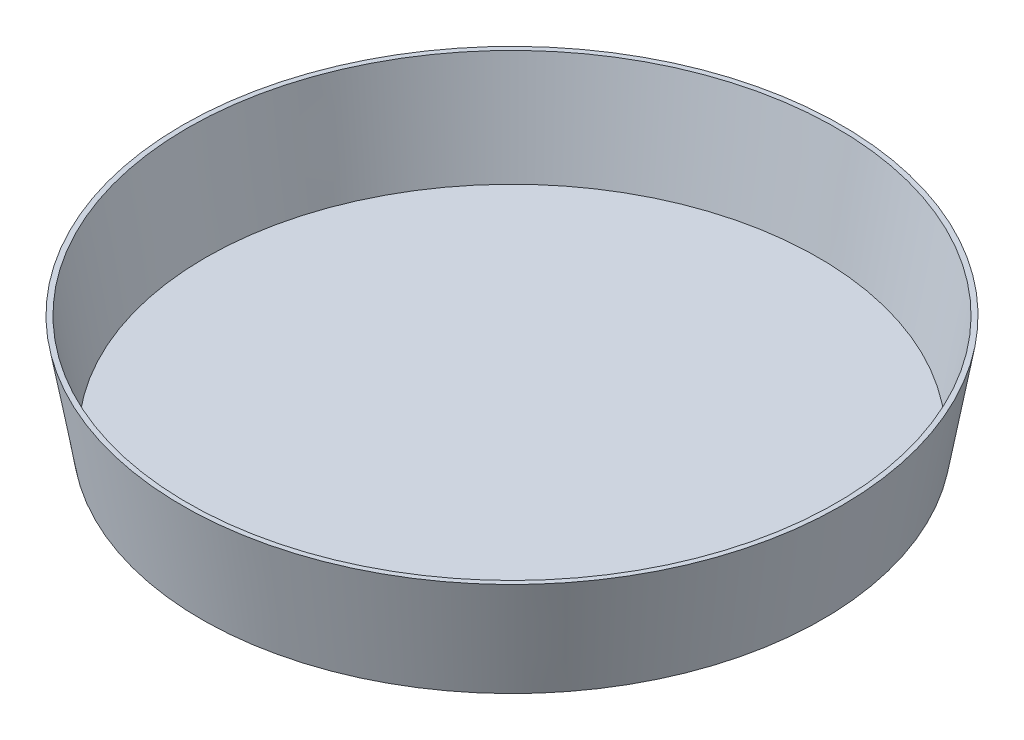
ISO-10303-21;
HEADER;
FILE_DESCRIPTION(('STEP AP214'),'2;1');
FILE_NAME('part.step','',(''),(''),'','','');
FILE_SCHEMA(('AUTOMOTIVE_DESIGN { 1 0 10303 214 1 1 1 1 }'));
ENDSEC;
DATA;
#1=APPLICATION_CONTEXT('core data for automotive mechanical design processes');
#2=APPLICATION_PROTOCOL_DEFINITION('international standard','automotive_design',2000,#1);
#3=PRODUCT_CONTEXT('',#1,'mechanical');
#4=PRODUCT('Part','Part','',(#3));
#5=PRODUCT_RELATED_PRODUCT_CATEGORY('part','',(#4));
#6=PRODUCT_DEFINITION_FORMATION('','',#4);
#7=PRODUCT_DEFINITION_CONTEXT('part definition',#1,'design');
#8=PRODUCT_DEFINITION('design','',#6,#7);
#9=PRODUCT_DEFINITION_SHAPE('','',#8);
#10=(LENGTH_UNIT() NAMED_UNIT(*) SI_UNIT(.MILLI.,.METRE.));
#11=(NAMED_UNIT(*) PLANE_ANGLE_UNIT() SI_UNIT($,.RADIAN.));
#12=(NAMED_UNIT(*) SI_UNIT($,.STERADIAN.) SOLID_ANGLE_UNIT());
#13=UNCERTAINTY_MEASURE_WITH_UNIT(LENGTH_MEASURE(1.E-05),#10,'distance_accuracy_value','');
#14=(GEOMETRIC_REPRESENTATION_CONTEXT(3) GLOBAL_UNCERTAINTY_ASSIGNED_CONTEXT((#13)) GLOBAL_UNIT_ASSIGNED_CONTEXT((#10,
#11,#12)) REPRESENTATION_CONTEXT('',''));
#15=CARTESIAN_POINT('',(0.,0.,0.));
#16=DIRECTION('',(0.,0.,1.));
#17=DIRECTION('',(1.,0.,0.));
#18=AXIS2_PLACEMENT_3D('',#15,#16,#17);
#19=CARTESIAN_POINT('',(200.,0.,0.));
#20=DIRECTION('',(0.,-1.,0.));
#21=DIRECTION('',(1.,0.,0.));
#22=AXIS2_PLACEMENT_3D('',#19,#20,#21);
#23=PLANE('',#22);
#24=CARTESIAN_POINT('',(0.,0.,0.));
#25=DIRECTION('',(0.,1.,0.));
#26=DIRECTION('',(-1.,0.,0.));
#27=AXIS2_PLACEMENT_3D('',#24,#25,#26);
#28=CIRCLE('',#27,200.);
#29=CARTESIAN_POINT('',(-200.,0.,0.));
#30=VERTEX_POINT('',#29);
#31=EDGE_CURVE('E48',#30,#30,#28,.T.);
#32=ORIENTED_EDGE('',*,*,#31,.F.);
#33=EDGE_LOOP('',(#32));
#34=FACE_BOUND('',#33,.T.);
#35=CARTESIAN_POINT('',(0.,0.,0.));
#36=DIRECTION('',(0.,-1.,0.));
#37=DIRECTION('',(1.,0.,0.));
#38=AXIS2_PLACEMENT_3D('',#35,#36,#37);
#39=CIRCLE('',#38,203.046279835657);
#40=CARTESIAN_POINT('',(203.046279835657,0.,0.));
#41=VERTEX_POINT('',#40);
#42=EDGE_CURVE('E37',#41,#41,#39,.F.);
#43=ORIENTED_EDGE('',*,*,#42,.T.);
#44=EDGE_LOOP('',(#43));
#45=FACE_BOUND('',#44,.T.);
#46=ADVANCED_FACE('F33',(#34,#45),#23,.F.);
#47=CARTESIAN_POINT('',(0.,-66.5,0.));
#48=DIRECTION('',(0.,1.,0.));
#49=DIRECTION('',(-1.,0.,0.));
#50=AXIS2_PLACEMENT_3D('',#47,#48,#49);
#51=PLANE('',#50);
#52=CARTESIAN_POINT('',(0.,-66.5,0.));
#53=DIRECTION('',(0.,1.,0.));
#54=DIRECTION('',(-1.,0.,0.));
#55=AXIS2_PLACEMENT_3D('',#52,#53,#54);
#56=CIRCLE('',#55,191.320535618545);
#57=CARTESIAN_POINT('',(-191.320535618545,-66.5,0.));
#58=VERTEX_POINT('',#57);
#59=EDGE_CURVE('E10',#58,#58,#56,.T.);
#60=ORIENTED_EDGE('',*,*,#59,.F.);
#61=EDGE_LOOP('',(#60));
#62=FACE_BOUND('',#61,.T.);
#63=ADVANCED_FACE('F57',(#62),#51,.F.);
#64=CARTESIAN_POINT('',(0.,-64.0209445330008,0.));
#65=DIRECTION('',(0.,1.,0.));
#66=DIRECTION('',(-1.,0.,0.));
#67=AXIS2_PLACEMENT_3D('',#64,#65,#66);
#68=CONICAL_SURFACE('',#67,191.757659984049,0.174532925199429);
#69=ORIENTED_EDGE('',*,*,#42,.F.);
#70=EDGE_LOOP('',(#69));
#71=FACE_BOUND('',#70,.T.);
#72=ORIENTED_EDGE('',*,*,#59,.T.);
#73=EDGE_LOOP('',(#72));
#74=FACE_BOUND('',#73,.T.);
#75=ADVANCED_FACE('F35',(#71,#74),#68,.T.);
#76=CARTESIAN_POINT('',(0.,-63.5,0.));
#77=DIRECTION('',(0.,1.,0.));
#78=DIRECTION('',(-1.,0.,0.));
#79=AXIS2_PLACEMENT_3D('',#76,#77,#78);
#80=PLANE('',#79);
#81=CARTESIAN_POINT('',(0.,-63.5,0.));
#82=DIRECTION('',(0.,1.,0.));
#83=DIRECTION('',(-1.,0.,0.));
#84=AXIS2_PLACEMENT_3D('',#81,#82,#83);
#85=CIRCLE('',#84,188.803236725013);
#86=CARTESIAN_POINT('',(-188.803236725013,-63.5000000000001,0.));
#87=VERTEX_POINT('',#86);
#88=EDGE_CURVE('E44',#87,#87,#85,.T.);
#89=ORIENTED_EDGE('',*,*,#88,.T.);
#90=EDGE_LOOP('',(#89));
#91=FACE_BOUND('',#90,.T.);
#92=ADVANCED_FACE('F62',(#91),#80,.T.);
#93=CARTESIAN_POINT('',(0.,-63.5,0.));
#94=DIRECTION('',(0.,1.,0.));
#95=DIRECTION('',(-1.,0.,0.));
#96=AXIS2_PLACEMENT_3D('',#93,#94,#95);
#97=CONICAL_SURFACE('',#96,188.803236725013,0.174532925199429);
#98=ORIENTED_EDGE('',*,*,#31,.T.);
#99=EDGE_LOOP('',(#98));
#100=FACE_BOUND('',#99,.T.);
#101=ORIENTED_EDGE('',*,*,#88,.F.);
#102=EDGE_LOOP('',(#101));
#103=FACE_BOUND('',#102,.T.);
#104=ADVANCED_FACE('F52',(#100,#103),#97,.F.);
#105=CLOSED_SHELL('',(#46,#63,#75,#92,#104));
#106=MANIFOLD_SOLID_BREP('B2',#105);
#107=ADVANCED_BREP_SHAPE_REPRESENTATION('',(#18,#106),#14);
#108=SHAPE_DEFINITION_REPRESENTATION(#9,#107);
ENDSEC;
END-ISO-10303-21;
